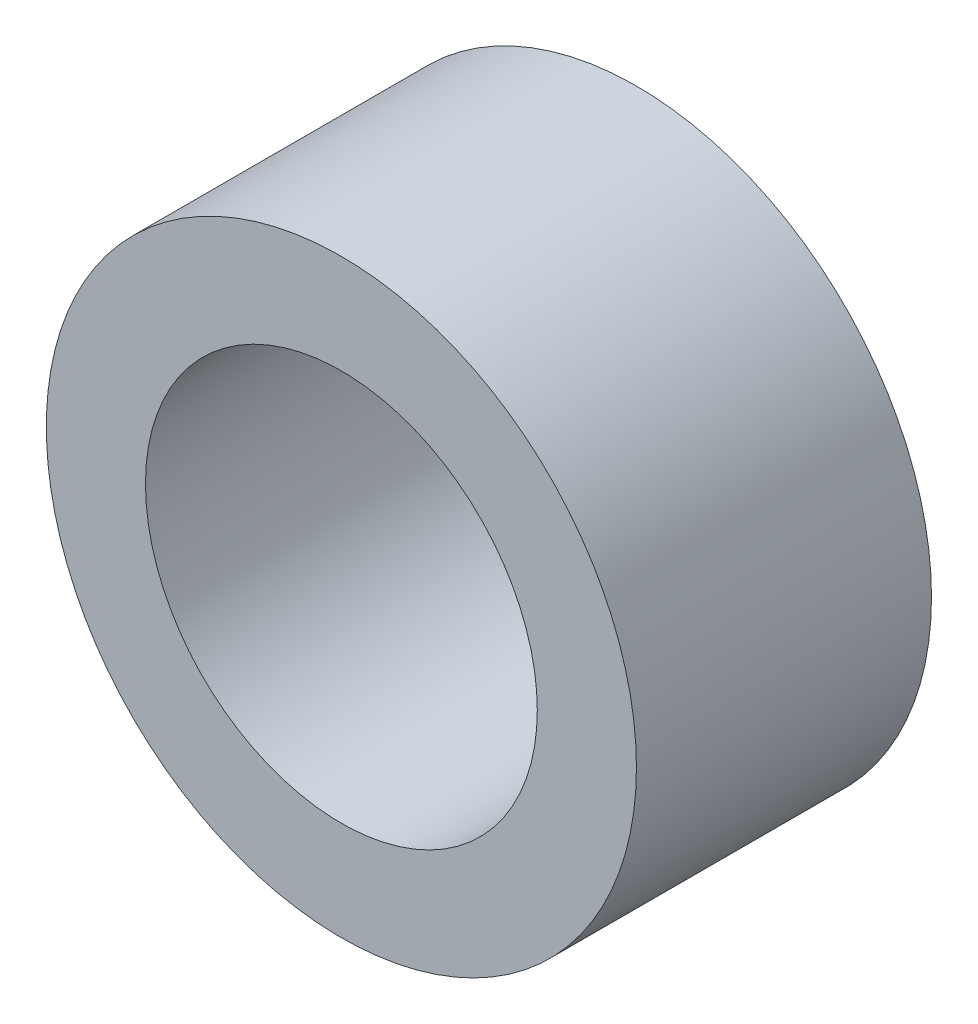
ISO-10303-21;
HEADER;
FILE_DESCRIPTION(('STEP AP214'),'2;1');
FILE_NAME('part.step','',(''),(''),'','','');
FILE_SCHEMA(('AUTOMOTIVE_DESIGN { 1 0 10303 214 1 1 1 1 }'));
ENDSEC;
DATA;
#1=APPLICATION_CONTEXT('core data for automotive mechanical design processes');
#2=APPLICATION_PROTOCOL_DEFINITION('international standard','automotive_design',2000,#1);
#3=PRODUCT_CONTEXT('',#1,'mechanical');
#4=PRODUCT('Part','Part','',(#3));
#5=PRODUCT_RELATED_PRODUCT_CATEGORY('part','',(#4));
#6=PRODUCT_DEFINITION_FORMATION('','',#4);
#7=PRODUCT_DEFINITION_CONTEXT('part definition',#1,'design');
#8=PRODUCT_DEFINITION('design','',#6,#7);
#9=PRODUCT_DEFINITION_SHAPE('','',#8);
#10=(LENGTH_UNIT() NAMED_UNIT(*) SI_UNIT(.MILLI.,.METRE.));
#11=(NAMED_UNIT(*) PLANE_ANGLE_UNIT() SI_UNIT($,.RADIAN.));
#12=(NAMED_UNIT(*) SI_UNIT($,.STERADIAN.) SOLID_ANGLE_UNIT());
#13=UNCERTAINTY_MEASURE_WITH_UNIT(LENGTH_MEASURE(1.E-05),#10,'distance_accuracy_value','');
#14=(GEOMETRIC_REPRESENTATION_CONTEXT(3) GLOBAL_UNCERTAINTY_ASSIGNED_CONTEXT((#13)) GLOBAL_UNIT_ASSIGNED_CONTEXT((#10,
#11,#12)) REPRESENTATION_CONTEXT('',''));
#15=CARTESIAN_POINT('',(0.,0.,0.));
#16=DIRECTION('',(0.,0.,1.));
#17=DIRECTION('',(1.,0.,0.));
#18=AXIS2_PLACEMENT_3D('',#15,#16,#17);
#19=CARTESIAN_POINT('',(0.,0.,1.5875));
#20=DIRECTION('',(0.,0.,1.));
#21=DIRECTION('',(1.,0.,0.));
#22=AXIS2_PLACEMENT_3D('',#19,#20,#21);
#23=PLANE('',#22);
#24=CARTESIAN_POINT('',(0.,0.,1.5875));
#25=DIRECTION('',(0.,0.,1.));
#26=DIRECTION('',(1.,0.,0.));
#27=AXIS2_PLACEMENT_3D('',#24,#25,#26);
#28=CIRCLE('',#27,3.175);
#29=CARTESIAN_POINT('',(3.175,0.,1.5875));
#30=VERTEX_POINT('',#29);
#31=EDGE_CURVE('E10',#30,#30,#28,.T.);
#32=ORIENTED_EDGE('',*,*,#31,.T.);
#33=EDGE_LOOP('',(#32));
#34=FACE_BOUND('',#33,.T.);
#35=CARTESIAN_POINT('',(0.,0.,1.5875));
#36=DIRECTION('',(0.,0.,1.));
#37=DIRECTION('',(1.,0.,0.));
#38=AXIS2_PLACEMENT_3D('',#35,#36,#37);
#39=CIRCLE('',#38,2.1082);
#40=CARTESIAN_POINT('',(2.1082,0.,1.5875));
#41=VERTEX_POINT('',#40);
#42=EDGE_CURVE('E41',#41,#41,#39,.T.);
#43=ORIENTED_EDGE('',*,*,#42,.F.);
#44=EDGE_LOOP('',(#43));
#45=FACE_BOUND('',#44,.T.);
#46=ADVANCED_FACE('F30',(#34,#45),#23,.T.);
#47=CARTESIAN_POINT('',(0.,0.,-1.5875));
#48=DIRECTION('',(0.,0.,1.));
#49=DIRECTION('',(1.,0.,0.));
#50=AXIS2_PLACEMENT_3D('',#47,#48,#49);
#51=PLANE('',#50);
#52=CARTESIAN_POINT('',(0.,0.,-1.5875));
#53=DIRECTION('',(0.,0.,1.));
#54=DIRECTION('',(1.,0.,0.));
#55=AXIS2_PLACEMENT_3D('',#52,#53,#54);
#56=CIRCLE('',#55,3.175);
#57=CARTESIAN_POINT('',(3.175,0.,-1.5875));
#58=VERTEX_POINT('',#57);
#59=EDGE_CURVE('E34',#58,#58,#56,.T.);
#60=ORIENTED_EDGE('',*,*,#59,.F.);
#61=EDGE_LOOP('',(#60));
#62=FACE_BOUND('',#61,.T.);
#63=CARTESIAN_POINT('',(0.,0.,-1.5875));
#64=DIRECTION('',(0.,0.,1.));
#65=DIRECTION('',(1.,0.,0.));
#66=AXIS2_PLACEMENT_3D('',#63,#64,#65);
#67=CIRCLE('',#66,2.1082);
#68=CARTESIAN_POINT('',(2.1082,0.,-1.5875));
#69=VERTEX_POINT('',#68);
#70=EDGE_CURVE('E43',#69,#69,#67,.T.);
#71=ORIENTED_EDGE('',*,*,#70,.T.);
#72=EDGE_LOOP('',(#71));
#73=FACE_BOUND('',#72,.T.);
#74=ADVANCED_FACE('F53',(#62,#73),#51,.F.);
#75=CARTESIAN_POINT('',(0.,0.,1.5875));
#76=DIRECTION('',(0.,0.,-1.));
#77=DIRECTION('',(-1.,0.,0.));
#78=AXIS2_PLACEMENT_3D('',#75,#76,#77);
#79=CYLINDRICAL_SURFACE('',#78,3.175);
#80=ORIENTED_EDGE('',*,*,#31,.F.);
#81=EDGE_LOOP('',(#80));
#82=FACE_BOUND('',#81,.T.);
#83=ORIENTED_EDGE('',*,*,#59,.T.);
#84=EDGE_LOOP('',(#83));
#85=FACE_BOUND('',#84,.T.);
#86=ADVANCED_FACE('F32',(#82,#85),#79,.T.);
#87=CARTESIAN_POINT('',(0.,0.,1.5875));
#88=DIRECTION('',(0.,0.,-1.));
#89=DIRECTION('',(-1.,0.,0.));
#90=AXIS2_PLACEMENT_3D('',#87,#88,#89);
#91=CYLINDRICAL_SURFACE('',#90,2.1082);
#92=ORIENTED_EDGE('',*,*,#42,.T.);
#93=EDGE_LOOP('',(#92));
#94=FACE_BOUND('',#93,.T.);
#95=ORIENTED_EDGE('',*,*,#70,.F.);
#96=EDGE_LOOP('',(#95));
#97=FACE_BOUND('',#96,.T.);
#98=ADVANCED_FACE('F49',(#94,#97),#91,.F.);
#99=CLOSED_SHELL('',(#46,#74,#86,#98));
#100=MANIFOLD_SOLID_BREP('B2',#99);
#101=ADVANCED_BREP_SHAPE_REPRESENTATION('',(#18,#100),#14);
#102=SHAPE_DEFINITION_REPRESENTATION(#9,#101);
ENDSEC;
END-ISO-10303-21;
